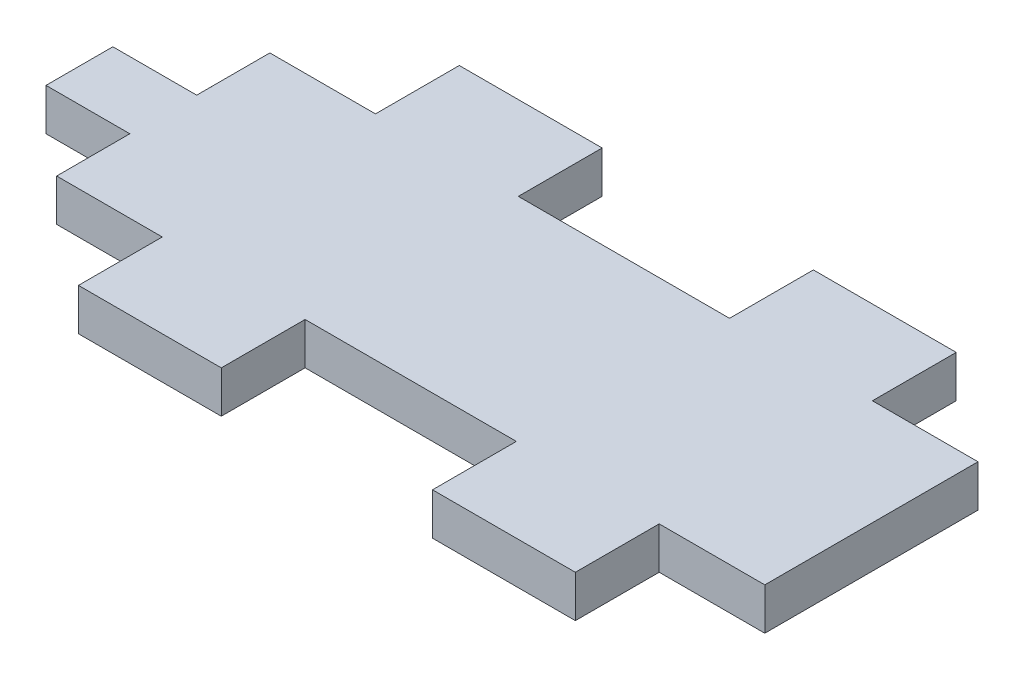
ISO-10303-21;
HEADER;
FILE_DESCRIPTION(('STEP AP214'),'2;1');
FILE_NAME('part.step','',(''),(''),'','','');
FILE_SCHEMA(('AUTOMOTIVE_DESIGN { 1 0 10303 214 1 1 1 1 }'));
ENDSEC;
DATA;
#1=APPLICATION_CONTEXT('core data for automotive mechanical design processes');
#2=APPLICATION_PROTOCOL_DEFINITION('international standard','automotive_design',2000,#1);
#3=PRODUCT_CONTEXT('',#1,'mechanical');
#4=PRODUCT('Part','Part','',(#3));
#5=PRODUCT_RELATED_PRODUCT_CATEGORY('part','',(#4));
#6=PRODUCT_DEFINITION_FORMATION('','',#4);
#7=PRODUCT_DEFINITION_CONTEXT('part definition',#1,'design');
#8=PRODUCT_DEFINITION('design','',#6,#7);
#9=PRODUCT_DEFINITION_SHAPE('','',#8);
#10=(LENGTH_UNIT() NAMED_UNIT(*) SI_UNIT(.MILLI.,.METRE.));
#11=(NAMED_UNIT(*) PLANE_ANGLE_UNIT() SI_UNIT($,.RADIAN.));
#12=(NAMED_UNIT(*) SI_UNIT($,.STERADIAN.) SOLID_ANGLE_UNIT());
#13=UNCERTAINTY_MEASURE_WITH_UNIT(LENGTH_MEASURE(1.E-05),#10,'distance_accuracy_value','');
#14=(GEOMETRIC_REPRESENTATION_CONTEXT(3) GLOBAL_UNCERTAINTY_ASSIGNED_CONTEXT((#13)) GLOBAL_UNIT_ASSIGNED_CONTEXT((#10,
#11,#12)) REPRESENTATION_CONTEXT('',''));
#15=CARTESIAN_POINT('',(0.,0.,0.));
#16=DIRECTION('',(0.,0.,1.));
#17=DIRECTION('',(1.,0.,0.));
#18=AXIS2_PLACEMENT_3D('',#15,#16,#17);
#19=CARTESIAN_POINT('',(26.82059633,3.175,8.075));
#20=DIRECTION('',(-1.,0.,0.));
#21=DIRECTION('',(0.,0.,1.));
#22=AXIS2_PLACEMENT_3D('',#19,#20,#21);
#23=PLANE('',#22);
#24=DIRECTION('',(0.,0.,-1.));
#25=VECTOR('',#24,1.);
#26=CARTESIAN_POINT('',(26.82059633,0.,8.075));
#27=LINE('',#26,#25);
#28=CARTESIAN_POINT('',(26.82059633,0.,8.075));
#29=VERTEX_POINT('',#28);
#30=CARTESIAN_POINT('',(26.82059633,0.,-8.075));
#31=VERTEX_POINT('',#30);
#32=EDGE_CURVE('E240',#29,#31,#27,.T.);
#33=ORIENTED_EDGE('',*,*,#32,.T.);
#34=DIRECTION('',(0.,-1.,0.));
#35=VECTOR('',#34,1.);
#36=CARTESIAN_POINT('',(26.82059633,3.175,-8.075));
#37=LINE('',#36,#35);
#38=CARTESIAN_POINT('',(26.82059633,3.175,-8.075));
#39=VERTEX_POINT('',#38);
#40=EDGE_CURVE('E11',#39,#31,#37,.T.);
#41=ORIENTED_EDGE('',*,*,#40,.F.);
#42=DIRECTION('',(0.,0.,-1.));
#43=VECTOR('',#42,1.);
#44=CARTESIAN_POINT('',(26.82059633,3.175,8.075));
#45=LINE('',#44,#43);
#46=CARTESIAN_POINT('',(26.82059633,3.175,8.075));
#47=VERTEX_POINT('',#46);
#48=EDGE_CURVE('E310',#47,#39,#45,.T.);
#49=ORIENTED_EDGE('',*,*,#48,.F.);
#50=DIRECTION('',(0.,-1.,0.));
#51=VECTOR('',#50,1.);
#52=CARTESIAN_POINT('',(26.82059633,3.175,8.075));
#53=LINE('',#52,#51);
#54=EDGE_CURVE('E236',#47,#29,#53,.T.);
#55=ORIENTED_EDGE('',*,*,#54,.T.);
#56=EDGE_LOOP('',(#33,#41,#49,#55));
#57=FACE_BOUND('',#56,.T.);
#58=ADVANCED_FACE('F43',(#57),#23,.F.);
#59=CARTESIAN_POINT('',(18.82059633,3.175,-8.075));
#60=DIRECTION('',(0.,0.,1.));
#61=DIRECTION('',(1.,0.,0.));
#62=AXIS2_PLACEMENT_3D('',#59,#60,#61);
#63=PLANE('',#62);
#64=DIRECTION('',(-1.,0.,0.));
#65=VECTOR('',#64,1.);
#66=CARTESIAN_POINT('',(18.82059633,0.,-8.075));
#67=LINE('',#66,#65);
#68=CARTESIAN_POINT('',(18.82059633,0.,-8.075));
#69=VERTEX_POINT('',#68);
#70=EDGE_CURVE('E244',#31,#69,#67,.T.);
#71=ORIENTED_EDGE('',*,*,#70,.T.);
#72=DIRECTION('',(0.,-1.,0.));
#73=VECTOR('',#72,1.);
#74=CARTESIAN_POINT('',(18.82059633,3.175,-8.075));
#75=LINE('',#74,#73);
#76=CARTESIAN_POINT('',(18.82059633,3.175,-8.075));
#77=VERTEX_POINT('',#76);
#78=EDGE_CURVE('E52',#77,#69,#75,.T.);
#79=ORIENTED_EDGE('',*,*,#78,.F.);
#80=DIRECTION('',(-1.,0.,0.));
#81=VECTOR('',#80,1.);
#82=CARTESIAN_POINT('',(18.82059633,3.175,-8.075));
#83=LINE('',#82,#81);
#84=EDGE_CURVE('E151',#39,#77,#83,.T.);
#85=ORIENTED_EDGE('',*,*,#84,.F.);
#86=ORIENTED_EDGE('',*,*,#40,.T.);
#87=EDGE_LOOP('',(#71,#79,#85,#86));
#88=FACE_BOUND('',#87,.T.);
#89=ADVANCED_FACE('F488',(#88),#63,.F.);
#90=CARTESIAN_POINT('',(18.82059633,3.175,-14.425));
#91=DIRECTION('',(-1.,0.,0.));
#92=DIRECTION('',(0.,0.,1.));
#93=AXIS2_PLACEMENT_3D('',#90,#91,#92);
#94=PLANE('',#93);
#95=DIRECTION('',(0.,0.,-1.));
#96=VECTOR('',#95,1.);
#97=CARTESIAN_POINT('',(18.82059633,0.,-14.425));
#98=LINE('',#97,#96);
#99=CARTESIAN_POINT('',(18.82059633,0.,-14.425));
#100=VERTEX_POINT('',#99);
#101=EDGE_CURVE('E247',#69,#100,#98,.T.);
#102=ORIENTED_EDGE('',*,*,#101,.T.);
#103=DIRECTION('',(0.,-1.,0.));
#104=VECTOR('',#103,1.);
#105=CARTESIAN_POINT('',(18.82059633,3.175,-14.425));
#106=LINE('',#105,#104);
#107=CARTESIAN_POINT('',(18.82059633,3.175,-14.425));
#108=VERTEX_POINT('',#107);
#109=EDGE_CURVE('E385',#108,#100,#106,.T.);
#110=ORIENTED_EDGE('',*,*,#109,.F.);
#111=DIRECTION('',(0.,0.,-1.));
#112=VECTOR('',#111,1.);
#113=CARTESIAN_POINT('',(18.82059633,3.175,-14.425));
#114=LINE('',#113,#112);
#115=EDGE_CURVE('E395',#77,#108,#114,.T.);
#116=ORIENTED_EDGE('',*,*,#115,.F.);
#117=ORIENTED_EDGE('',*,*,#78,.T.);
#118=EDGE_LOOP('',(#102,#110,#116,#117));
#119=FACE_BOUND('',#118,.T.);
#120=ADVANCED_FACE('F393',(#119),#94,.F.);
#121=CARTESIAN_POINT('',(8.,3.175,-14.425));
#122=DIRECTION('',(0.,0.,1.));
#123=DIRECTION('',(1.,0.,0.));
#124=AXIS2_PLACEMENT_3D('',#121,#122,#123);
#125=PLANE('',#124);
#126=DIRECTION('',(-1.,0.,0.));
#127=VECTOR('',#126,1.);
#128=CARTESIAN_POINT('',(8.,0.,-14.425));
#129=LINE('',#128,#127);
#130=CARTESIAN_POINT('',(8.,0.,-14.425));
#131=VERTEX_POINT('',#130);
#132=EDGE_CURVE('E250',#100,#131,#129,.T.);
#133=ORIENTED_EDGE('',*,*,#132,.T.);
#134=DIRECTION('',(0.,-1.,0.));
#135=VECTOR('',#134,1.);
#136=CARTESIAN_POINT('',(8.,3.175,-14.425));
#137=LINE('',#136,#135);
#138=CARTESIAN_POINT('',(8.,3.175,-14.425));
#139=VERTEX_POINT('',#138);
#140=EDGE_CURVE('E381',#139,#131,#137,.T.);
#141=ORIENTED_EDGE('',*,*,#140,.F.);
#142=DIRECTION('',(-1.,0.,0.));
#143=VECTOR('',#142,1.);
#144=CARTESIAN_POINT('',(8.,3.175,-14.425));
#145=LINE('',#144,#143);
#146=EDGE_CURVE('E414',#108,#139,#145,.T.);
#147=ORIENTED_EDGE('',*,*,#146,.F.);
#148=ORIENTED_EDGE('',*,*,#109,.T.);
#149=EDGE_LOOP('',(#133,#141,#147,#148));
#150=FACE_BOUND('',#149,.T.);
#151=ADVANCED_FACE('F404',(#150),#125,.F.);
#152=CARTESIAN_POINT('',(8.,3.175,-8.075));
#153=DIRECTION('',(1.,0.,0.));
#154=DIRECTION('',(0.,0.,-1.));
#155=AXIS2_PLACEMENT_3D('',#152,#153,#154);
#156=PLANE('',#155);
#157=DIRECTION('',(0.,0.,1.));
#158=VECTOR('',#157,1.);
#159=CARTESIAN_POINT('',(8.,0.,-8.075));
#160=LINE('',#159,#158);
#161=CARTESIAN_POINT('',(8.,0.,-8.075));
#162=VERTEX_POINT('',#161);
#163=EDGE_CURVE('E253',#131,#162,#160,.T.);
#164=ORIENTED_EDGE('',*,*,#163,.T.);
#165=DIRECTION('',(0.,-1.,0.));
#166=VECTOR('',#165,1.);
#167=CARTESIAN_POINT('',(8.,3.175,-8.075));
#168=LINE('',#167,#166);
#169=CARTESIAN_POINT('',(8.,3.175,-8.075));
#170=VERTEX_POINT('',#169);
#171=EDGE_CURVE('E377',#170,#162,#168,.T.);
#172=ORIENTED_EDGE('',*,*,#171,.F.);
#173=DIRECTION('',(0.,0.,1.));
#174=VECTOR('',#173,1.);
#175=CARTESIAN_POINT('',(8.,3.175,-8.075));
#176=LINE('',#175,#174);
#177=EDGE_CURVE('E410',#139,#170,#176,.T.);
#178=ORIENTED_EDGE('',*,*,#177,.F.);
#179=ORIENTED_EDGE('',*,*,#140,.T.);
#180=EDGE_LOOP('',(#164,#172,#178,#179));
#181=FACE_BOUND('',#180,.T.);
#182=ADVANCED_FACE('F408',(#181),#156,.F.);
#183=CARTESIAN_POINT('',(-7.99999999999999,3.175,-8.075));
#184=DIRECTION('',(0.,0.,1.));
#185=DIRECTION('',(1.,0.,0.));
#186=AXIS2_PLACEMENT_3D('',#183,#184,#185);
#187=PLANE('',#186);
#188=DIRECTION('',(-1.,0.,0.));
#189=VECTOR('',#188,1.);
#190=CARTESIAN_POINT('',(-7.99999999999999,0.,-8.075));
#191=LINE('',#190,#189);
#192=CARTESIAN_POINT('',(-7.99999999999999,0.,-8.075));
#193=VERTEX_POINT('',#192);
#194=EDGE_CURVE('E256',#162,#193,#191,.T.);
#195=ORIENTED_EDGE('',*,*,#194,.T.);
#196=DIRECTION('',(0.,-1.,0.));
#197=VECTOR('',#196,1.);
#198=CARTESIAN_POINT('',(-7.99999999999999,3.175,-8.075));
#199=LINE('',#198,#197);
#200=CARTESIAN_POINT('',(-7.99999999999999,3.175,-8.075));
#201=VERTEX_POINT('',#200);
#202=EDGE_CURVE('E373',#201,#193,#199,.T.);
#203=ORIENTED_EDGE('',*,*,#202,.F.);
#204=DIRECTION('',(-1.,0.,0.));
#205=VECTOR('',#204,1.);
#206=CARTESIAN_POINT('',(-7.99999999999999,3.175,-8.075));
#207=LINE('',#206,#205);
#208=EDGE_CURVE('E413',#170,#201,#207,.T.);
#209=ORIENTED_EDGE('',*,*,#208,.F.);
#210=ORIENTED_EDGE('',*,*,#171,.T.);
#211=EDGE_LOOP('',(#195,#203,#209,#210));
#212=FACE_BOUND('',#211,.T.);
#213=ADVANCED_FACE('F501',(#212),#187,.F.);
#214=CARTESIAN_POINT('',(-7.99999999999999,3.175,-8.075));
#215=DIRECTION('',(-1.,0.,0.));
#216=DIRECTION('',(0.,0.,1.));
#217=AXIS2_PLACEMENT_3D('',#214,#215,#216);
#218=PLANE('',#217);
#219=DIRECTION('',(0.,0.,-1.));
#220=VECTOR('',#219,1.);
#221=CARTESIAN_POINT('',(-7.99999999999999,0.,-8.075));
#222=LINE('',#221,#220);
#223=CARTESIAN_POINT('',(-7.99999999999999,0.,-14.425));
#224=VERTEX_POINT('',#223);
#225=EDGE_CURVE('E259',#193,#224,#222,.T.);
#226=ORIENTED_EDGE('',*,*,#225,.T.);
#227=DIRECTION('',(0.,-1.,0.));
#228=VECTOR('',#227,1.);
#229=CARTESIAN_POINT('',(-7.99999999999999,3.175,-14.425));
#230=LINE('',#229,#228);
#231=CARTESIAN_POINT('',(-7.99999999999999,3.175,-14.425));
#232=VERTEX_POINT('',#231);
#233=EDGE_CURVE('E369',#232,#224,#230,.T.);
#234=ORIENTED_EDGE('',*,*,#233,.F.);
#235=DIRECTION('',(0.,0.,-1.));
#236=VECTOR('',#235,1.);
#237=CARTESIAN_POINT('',(-7.99999999999999,3.175,-8.075));
#238=LINE('',#237,#236);
#239=EDGE_CURVE('E418',#201,#232,#238,.T.);
#240=ORIENTED_EDGE('',*,*,#239,.F.);
#241=ORIENTED_EDGE('',*,*,#202,.T.);
#242=EDGE_LOOP('',(#226,#234,#240,#241));
#243=FACE_BOUND('',#242,.T.);
#244=ADVANCED_FACE('F504',(#243),#218,.F.);
#245=CARTESIAN_POINT('',(-7.99999999999999,3.175,-14.425));
#246=DIRECTION('',(0.,0.,1.));
#247=DIRECTION('',(1.,0.,0.));
#248=AXIS2_PLACEMENT_3D('',#245,#246,#247);
#249=PLANE('',#248);
#250=DIRECTION('',(-1.,0.,0.));
#251=VECTOR('',#250,1.);
#252=CARTESIAN_POINT('',(-7.99999999999999,0.,-14.425));
#253=LINE('',#252,#251);
#254=CARTESIAN_POINT('',(-18.82059633,0.,-14.425));
#255=VERTEX_POINT('',#254);
#256=EDGE_CURVE('E262',#224,#255,#253,.T.);
#257=ORIENTED_EDGE('',*,*,#256,.T.);
#258=DIRECTION('',(0.,-1.,0.));
#259=VECTOR('',#258,1.);
#260=CARTESIAN_POINT('',(-18.82059633,3.175,-14.425));
#261=LINE('',#260,#259);
#262=CARTESIAN_POINT('',(-18.82059633,3.175,-14.425));
#263=VERTEX_POINT('',#262);
#264=EDGE_CURVE('E365',#263,#255,#261,.T.);
#265=ORIENTED_EDGE('',*,*,#264,.F.);
#266=DIRECTION('',(-1.,0.,0.));
#267=VECTOR('',#266,1.);
#268=CARTESIAN_POINT('',(-7.99999999999999,3.175,-14.425));
#269=LINE('',#268,#267);
#270=EDGE_CURVE('E425',#232,#263,#269,.T.);
#271=ORIENTED_EDGE('',*,*,#270,.F.);
#272=ORIENTED_EDGE('',*,*,#233,.T.);
#273=EDGE_LOOP('',(#257,#265,#271,#272));
#274=FACE_BOUND('',#273,.T.);
#275=ADVANCED_FACE('F508',(#274),#249,.F.);
#276=CARTESIAN_POINT('',(-18.82059633,3.175,-14.425));
#277=DIRECTION('',(1.,0.,0.));
#278=DIRECTION('',(0.,0.,-1.));
#279=AXIS2_PLACEMENT_3D('',#276,#277,#278);
#280=PLANE('',#279);
#281=DIRECTION('',(0.,0.,1.));
#282=VECTOR('',#281,1.);
#283=CARTESIAN_POINT('',(-18.82059633,0.,-14.425));
#284=LINE('',#283,#282);
#285=CARTESIAN_POINT('',(-18.82059633,0.,-8.075));
#286=VERTEX_POINT('',#285);
#287=EDGE_CURVE('E265',#255,#286,#284,.T.);
#288=ORIENTED_EDGE('',*,*,#287,.T.);
#289=DIRECTION('',(0.,-1.,0.));
#290=VECTOR('',#289,1.);
#291=CARTESIAN_POINT('',(-18.82059633,3.175,-8.075));
#292=LINE('',#291,#290);
#293=CARTESIAN_POINT('',(-18.82059633,3.175,-8.075));
#294=VERTEX_POINT('',#293);
#295=EDGE_CURVE('E361',#294,#286,#292,.T.);
#296=ORIENTED_EDGE('',*,*,#295,.F.);
#297=DIRECTION('',(0.,0.,1.));
#298=VECTOR('',#297,1.);
#299=CARTESIAN_POINT('',(-18.82059633,3.175,-14.425));
#300=LINE('',#299,#298);
#301=EDGE_CURVE('E428',#263,#294,#300,.T.);
#302=ORIENTED_EDGE('',*,*,#301,.F.);
#303=ORIENTED_EDGE('',*,*,#264,.T.);
#304=EDGE_LOOP('',(#288,#296,#302,#303));
#305=FACE_BOUND('',#304,.T.);
#306=ADVANCED_FACE('F512',(#305),#280,.F.);
#307=CARTESIAN_POINT('',(-18.82059633,3.175,-8.075));
#308=DIRECTION('',(0.,0.,1.));
#309=DIRECTION('',(1.,0.,0.));
#310=AXIS2_PLACEMENT_3D('',#307,#308,#309);
#311=PLANE('',#310);
#312=DIRECTION('',(-1.,0.,0.));
#313=VECTOR('',#312,1.);
#314=CARTESIAN_POINT('',(-18.82059633,0.,-8.075));
#315=LINE('',#314,#313);
#316=CARTESIAN_POINT('',(-26.82059633,0.,-8.075));
#317=VERTEX_POINT('',#316);
#318=EDGE_CURVE('E268',#286,#317,#315,.T.);
#319=ORIENTED_EDGE('',*,*,#318,.T.);
#320=DIRECTION('',(0.,-1.,0.));
#321=VECTOR('',#320,1.);
#322=CARTESIAN_POINT('',(-26.82059633,3.175,-8.075));
#323=LINE('',#322,#321);
#324=CARTESIAN_POINT('',(-26.82059633,3.175,-8.075));
#325=VERTEX_POINT('',#324);
#326=EDGE_CURVE('E357',#325,#317,#323,.T.);
#327=ORIENTED_EDGE('',*,*,#326,.F.);
#328=DIRECTION('',(-1.,0.,0.));
#329=VECTOR('',#328,1.);
#330=CARTESIAN_POINT('',(-18.82059633,3.175,-8.075));
#331=LINE('',#330,#329);
#332=EDGE_CURVE('E431',#294,#325,#331,.T.);
#333=ORIENTED_EDGE('',*,*,#332,.F.);
#334=ORIENTED_EDGE('',*,*,#295,.T.);
#335=EDGE_LOOP('',(#319,#327,#333,#334));
#336=FACE_BOUND('',#335,.T.);
#337=ADVANCED_FACE('F516',(#336),#311,.F.);
#338=CARTESIAN_POINT('',(-26.82059633,3.175,-8.075));
#339=DIRECTION('',(1.,0.,0.));
#340=DIRECTION('',(0.,0.,-1.));
#341=AXIS2_PLACEMENT_3D('',#338,#339,#340);
#342=PLANE('',#341);
#343=DIRECTION('',(0.,0.,1.));
#344=VECTOR('',#343,1.);
#345=CARTESIAN_POINT('',(-26.82059633,0.,-8.075));
#346=LINE('',#345,#344);
#347=CARTESIAN_POINT('',(-26.82059633,0.,-2.5325));
#348=VERTEX_POINT('',#347);
#349=EDGE_CURVE('E271',#317,#348,#346,.T.);
#350=ORIENTED_EDGE('',*,*,#349,.T.);
#351=DIRECTION('',(0.,-1.,0.));
#352=VECTOR('',#351,1.);
#353=CARTESIAN_POINT('',(-26.82059633,3.175,-2.5325));
#354=LINE('',#353,#352);
#355=CARTESIAN_POINT('',(-26.82059633,3.175,-2.5325));
#356=VERTEX_POINT('',#355);
#357=EDGE_CURVE('E353',#356,#348,#354,.T.);
#358=ORIENTED_EDGE('',*,*,#357,.F.);
#359=DIRECTION('',(0.,0.,1.));
#360=VECTOR('',#359,1.);
#361=CARTESIAN_POINT('',(-26.82059633,3.175,-8.075));
#362=LINE('',#361,#360);
#363=EDGE_CURVE('E434',#325,#356,#362,.T.);
#364=ORIENTED_EDGE('',*,*,#363,.F.);
#365=ORIENTED_EDGE('',*,*,#326,.T.);
#366=EDGE_LOOP('',(#350,#358,#364,#365));
#367=FACE_BOUND('',#366,.T.);
#368=ADVANCED_FACE('F520',(#367),#342,.F.);
#369=CARTESIAN_POINT('',(-33.17059633,3.175,-2.5325));
#370=DIRECTION('',(0.,0.,1.));
#371=DIRECTION('',(1.,0.,0.));
#372=AXIS2_PLACEMENT_3D('',#369,#370,#371);
#373=PLANE('',#372);
#374=DIRECTION('',(-1.,0.,0.));
#375=VECTOR('',#374,1.);
#376=CARTESIAN_POINT('',(-33.17059633,0.,-2.5325));
#377=LINE('',#376,#375);
#378=CARTESIAN_POINT('',(-33.17059633,0.,-2.5325));
#379=VERTEX_POINT('',#378);
#380=EDGE_CURVE('E274',#348,#379,#377,.T.);
#381=ORIENTED_EDGE('',*,*,#380,.T.);
#382=DIRECTION('',(0.,-1.,0.));
#383=VECTOR('',#382,1.);
#384=CARTESIAN_POINT('',(-33.17059633,3.175,-2.5325));
#385=LINE('',#384,#383);
#386=CARTESIAN_POINT('',(-33.17059633,3.175,-2.5325));
#387=VERTEX_POINT('',#386);
#388=EDGE_CURVE('E349',#387,#379,#385,.T.);
#389=ORIENTED_EDGE('',*,*,#388,.F.);
#390=DIRECTION('',(-1.,0.,0.));
#391=VECTOR('',#390,1.);
#392=CARTESIAN_POINT('',(-33.17059633,3.175,-2.5325));
#393=LINE('',#392,#391);
#394=EDGE_CURVE('E437',#356,#387,#393,.T.);
#395=ORIENTED_EDGE('',*,*,#394,.F.);
#396=ORIENTED_EDGE('',*,*,#357,.T.);
#397=EDGE_LOOP('',(#381,#389,#395,#396));
#398=FACE_BOUND('',#397,.T.);
#399=ADVANCED_FACE('F524',(#398),#373,.F.);
#400=CARTESIAN_POINT('',(-33.17059633,3.175,2.5325));
#401=DIRECTION('',(1.,0.,0.));
#402=DIRECTION('',(0.,0.,-1.));
#403=AXIS2_PLACEMENT_3D('',#400,#401,#402);
#404=PLANE('',#403);
#405=DIRECTION('',(0.,0.,1.));
#406=VECTOR('',#405,1.);
#407=CARTESIAN_POINT('',(-33.17059633,0.,2.5325));
#408=LINE('',#407,#406);
#409=CARTESIAN_POINT('',(-33.17059633,0.,2.5325));
#410=VERTEX_POINT('',#409);
#411=EDGE_CURVE('E277',#379,#410,#408,.T.);
#412=ORIENTED_EDGE('',*,*,#411,.T.);
#413=DIRECTION('',(0.,-1.,0.));
#414=VECTOR('',#413,1.);
#415=CARTESIAN_POINT('',(-33.17059633,3.175,2.5325));
#416=LINE('',#415,#414);
#417=CARTESIAN_POINT('',(-33.17059633,3.175,2.5325));
#418=VERTEX_POINT('',#417);
#419=EDGE_CURVE('E345',#418,#410,#416,.T.);
#420=ORIENTED_EDGE('',*,*,#419,.F.);
#421=DIRECTION('',(0.,0.,1.));
#422=VECTOR('',#421,1.);
#423=CARTESIAN_POINT('',(-33.17059633,3.175,2.5325));
#424=LINE('',#423,#422);
#425=EDGE_CURVE('E440',#387,#418,#424,.T.);
#426=ORIENTED_EDGE('',*,*,#425,.F.);
#427=ORIENTED_EDGE('',*,*,#388,.T.);
#428=EDGE_LOOP('',(#412,#420,#426,#427));
#429=FACE_BOUND('',#428,.T.);
#430=ADVANCED_FACE('F528',(#429),#404,.F.);
#431=CARTESIAN_POINT('',(-33.17059633,3.175,2.5325));
#432=DIRECTION('',(0.,0.,-1.));
#433=DIRECTION('',(-1.,0.,0.));
#434=AXIS2_PLACEMENT_3D('',#431,#432,#433);
#435=PLANE('',#434);
#436=DIRECTION('',(1.,0.,0.));
#437=VECTOR('',#436,1.);
#438=CARTESIAN_POINT('',(-33.17059633,0.,2.5325));
#439=LINE('',#438,#437);
#440=CARTESIAN_POINT('',(-26.82059633,0.,2.5325));
#441=VERTEX_POINT('',#440);
#442=EDGE_CURVE('E280',#410,#441,#439,.T.);
#443=ORIENTED_EDGE('',*,*,#442,.T.);
#444=DIRECTION('',(0.,-1.,0.));
#445=VECTOR('',#444,1.);
#446=CARTESIAN_POINT('',(-26.82059633,3.175,2.5325));
#447=LINE('',#446,#445);
#448=CARTESIAN_POINT('',(-26.82059633,3.175,2.5325));
#449=VERTEX_POINT('',#448);
#450=EDGE_CURVE('E341',#449,#441,#447,.T.);
#451=ORIENTED_EDGE('',*,*,#450,.F.);
#452=DIRECTION('',(1.,0.,0.));
#453=VECTOR('',#452,1.);
#454=CARTESIAN_POINT('',(-33.17059633,3.175,2.5325));
#455=LINE('',#454,#453);
#456=EDGE_CURVE('E443',#418,#449,#455,.T.);
#457=ORIENTED_EDGE('',*,*,#456,.F.);
#458=ORIENTED_EDGE('',*,*,#419,.T.);
#459=EDGE_LOOP('',(#443,#451,#457,#458));
#460=FACE_BOUND('',#459,.T.);
#461=ADVANCED_FACE('F532',(#460),#435,.F.);
#462=CARTESIAN_POINT('',(-26.82059633,3.175,8.075));
#463=DIRECTION('',(1.,0.,0.));
#464=DIRECTION('',(0.,0.,-1.));
#465=AXIS2_PLACEMENT_3D('',#462,#463,#464);
#466=PLANE('',#465);
#467=DIRECTION('',(0.,0.,1.));
#468=VECTOR('',#467,1.);
#469=CARTESIAN_POINT('',(-26.82059633,0.,8.075));
#470=LINE('',#469,#468);
#471=CARTESIAN_POINT('',(-26.82059633,0.,8.075));
#472=VERTEX_POINT('',#471);
#473=EDGE_CURVE('E283',#441,#472,#470,.T.);
#474=ORIENTED_EDGE('',*,*,#473,.T.);
#475=DIRECTION('',(0.,-1.,0.));
#476=VECTOR('',#475,1.);
#477=CARTESIAN_POINT('',(-26.82059633,3.175,8.075));
#478=LINE('',#477,#476);
#479=CARTESIAN_POINT('',(-26.82059633,3.175,8.075));
#480=VERTEX_POINT('',#479);
#481=EDGE_CURVE('E337',#480,#472,#478,.T.);
#482=ORIENTED_EDGE('',*,*,#481,.F.);
#483=DIRECTION('',(0.,0.,1.));
#484=VECTOR('',#483,1.);
#485=CARTESIAN_POINT('',(-26.82059633,3.175,8.075));
#486=LINE('',#485,#484);
#487=EDGE_CURVE('E446',#449,#480,#486,.T.);
#488=ORIENTED_EDGE('',*,*,#487,.F.);
#489=ORIENTED_EDGE('',*,*,#450,.T.);
#490=EDGE_LOOP('',(#474,#482,#488,#489));
#491=FACE_BOUND('',#490,.T.);
#492=ADVANCED_FACE('F536',(#491),#466,.F.);
#493=CARTESIAN_POINT('',(-18.82059633,3.175,8.075));
#494=DIRECTION('',(0.,0.,-1.));
#495=DIRECTION('',(-1.,0.,0.));
#496=AXIS2_PLACEMENT_3D('',#493,#494,#495);
#497=PLANE('',#496);
#498=DIRECTION('',(1.,0.,0.));
#499=VECTOR('',#498,1.);
#500=CARTESIAN_POINT('',(-18.82059633,0.,8.075));
#501=LINE('',#500,#499);
#502=CARTESIAN_POINT('',(-18.82059633,0.,8.075));
#503=VERTEX_POINT('',#502);
#504=EDGE_CURVE('E286',#472,#503,#501,.T.);
#505=ORIENTED_EDGE('',*,*,#504,.T.);
#506=DIRECTION('',(0.,-1.,0.));
#507=VECTOR('',#506,1.);
#508=CARTESIAN_POINT('',(-18.82059633,3.175,8.075));
#509=LINE('',#508,#507);
#510=CARTESIAN_POINT('',(-18.82059633,3.175,8.075));
#511=VERTEX_POINT('',#510);
#512=EDGE_CURVE('E333',#511,#503,#509,.T.);
#513=ORIENTED_EDGE('',*,*,#512,.F.);
#514=DIRECTION('',(1.,0.,0.));
#515=VECTOR('',#514,1.);
#516=CARTESIAN_POINT('',(-18.82059633,3.175,8.075));
#517=LINE('',#516,#515);
#518=EDGE_CURVE('E449',#480,#511,#517,.T.);
#519=ORIENTED_EDGE('',*,*,#518,.F.);
#520=ORIENTED_EDGE('',*,*,#481,.T.);
#521=EDGE_LOOP('',(#505,#513,#519,#520));
#522=FACE_BOUND('',#521,.T.);
#523=ADVANCED_FACE('F540',(#522),#497,.F.);
#524=CARTESIAN_POINT('',(-18.82059633,3.175,14.425));
#525=DIRECTION('',(1.,0.,0.));
#526=DIRECTION('',(0.,0.,-1.));
#527=AXIS2_PLACEMENT_3D('',#524,#525,#526);
#528=PLANE('',#527);
#529=DIRECTION('',(0.,0.,1.));
#530=VECTOR('',#529,1.);
#531=CARTESIAN_POINT('',(-18.82059633,0.,14.425));
#532=LINE('',#531,#530);
#533=CARTESIAN_POINT('',(-18.82059633,0.,14.425));
#534=VERTEX_POINT('',#533);
#535=EDGE_CURVE('E289',#503,#534,#532,.T.);
#536=ORIENTED_EDGE('',*,*,#535,.T.);
#537=DIRECTION('',(0.,-1.,0.));
#538=VECTOR('',#537,1.);
#539=CARTESIAN_POINT('',(-18.82059633,3.175,14.425));
#540=LINE('',#539,#538);
#541=CARTESIAN_POINT('',(-18.82059633,3.175,14.425));
#542=VERTEX_POINT('',#541);
#543=EDGE_CURVE('E329',#542,#534,#540,.T.);
#544=ORIENTED_EDGE('',*,*,#543,.F.);
#545=DIRECTION('',(0.,0.,1.));
#546=VECTOR('',#545,1.);
#547=CARTESIAN_POINT('',(-18.82059633,3.175,14.425));
#548=LINE('',#547,#546);
#549=EDGE_CURVE('E452',#511,#542,#548,.T.);
#550=ORIENTED_EDGE('',*,*,#549,.F.);
#551=ORIENTED_EDGE('',*,*,#512,.T.);
#552=EDGE_LOOP('',(#536,#544,#550,#551));
#553=FACE_BOUND('',#552,.T.);
#554=ADVANCED_FACE('F544',(#553),#528,.F.);
#555=CARTESIAN_POINT('',(-7.99999999999999,3.175,14.425));
#556=DIRECTION('',(0.,0.,-1.));
#557=DIRECTION('',(-1.,0.,0.));
#558=AXIS2_PLACEMENT_3D('',#555,#556,#557);
#559=PLANE('',#558);
#560=DIRECTION('',(1.,0.,0.));
#561=VECTOR('',#560,1.);
#562=CARTESIAN_POINT('',(-7.99999999999999,0.,14.425));
#563=LINE('',#562,#561);
#564=CARTESIAN_POINT('',(-7.99999999999999,0.,14.425));
#565=VERTEX_POINT('',#564);
#566=EDGE_CURVE('E292',#534,#565,#563,.T.);
#567=ORIENTED_EDGE('',*,*,#566,.T.);
#568=DIRECTION('',(0.,-1.,0.));
#569=VECTOR('',#568,1.);
#570=CARTESIAN_POINT('',(-7.99999999999999,3.175,14.425));
#571=LINE('',#570,#569);
#572=CARTESIAN_POINT('',(-7.99999999999999,3.175,14.425));
#573=VERTEX_POINT('',#572);
#574=EDGE_CURVE('E325',#573,#565,#571,.T.);
#575=ORIENTED_EDGE('',*,*,#574,.F.);
#576=DIRECTION('',(1.,0.,0.));
#577=VECTOR('',#576,1.);
#578=CARTESIAN_POINT('',(-7.99999999999999,3.175,14.425));
#579=LINE('',#578,#577);
#580=EDGE_CURVE('E455',#542,#573,#579,.T.);
#581=ORIENTED_EDGE('',*,*,#580,.F.);
#582=ORIENTED_EDGE('',*,*,#543,.T.);
#583=EDGE_LOOP('',(#567,#575,#581,#582));
#584=FACE_BOUND('',#583,.T.);
#585=ADVANCED_FACE('F548',(#584),#559,.F.);
#586=CARTESIAN_POINT('',(-7.99999999999999,3.175,8.075));
#587=DIRECTION('',(-1.,0.,0.));
#588=DIRECTION('',(0.,0.,1.));
#589=AXIS2_PLACEMENT_3D('',#586,#587,#588);
#590=PLANE('',#589);
#591=DIRECTION('',(0.,0.,-1.));
#592=VECTOR('',#591,1.);
#593=CARTESIAN_POINT('',(-7.99999999999999,0.,8.075));
#594=LINE('',#593,#592);
#595=CARTESIAN_POINT('',(-7.99999999999999,0.,8.075));
#596=VERTEX_POINT('',#595);
#597=EDGE_CURVE('E295',#565,#596,#594,.T.);
#598=ORIENTED_EDGE('',*,*,#597,.T.);
#599=DIRECTION('',(0.,-1.,0.));
#600=VECTOR('',#599,1.);
#601=CARTESIAN_POINT('',(-7.99999999999999,3.175,8.075));
#602=LINE('',#601,#600);
#603=CARTESIAN_POINT('',(-7.99999999999999,3.175,8.075));
#604=VERTEX_POINT('',#603);
#605=EDGE_CURVE('E321',#604,#596,#602,.T.);
#606=ORIENTED_EDGE('',*,*,#605,.F.);
#607=DIRECTION('',(0.,0.,-1.));
#608=VECTOR('',#607,1.);
#609=CARTESIAN_POINT('',(-7.99999999999999,3.175,8.075));
#610=LINE('',#609,#608);
#611=EDGE_CURVE('E458',#573,#604,#610,.T.);
#612=ORIENTED_EDGE('',*,*,#611,.F.);
#613=ORIENTED_EDGE('',*,*,#574,.T.);
#614=EDGE_LOOP('',(#598,#606,#612,#613));
#615=FACE_BOUND('',#614,.T.);
#616=ADVANCED_FACE('F552',(#615),#590,.F.);
#617=CARTESIAN_POINT('',(-7.99999999999999,3.175,8.075));
#618=DIRECTION('',(0.,0.,-1.));
#619=DIRECTION('',(-1.,0.,0.));
#620=AXIS2_PLACEMENT_3D('',#617,#618,#619);
#621=PLANE('',#620);
#622=DIRECTION('',(1.,0.,0.));
#623=VECTOR('',#622,1.);
#624=CARTESIAN_POINT('',(-7.99999999999999,0.,8.075));
#625=LINE('',#624,#623);
#626=CARTESIAN_POINT('',(8.,0.,8.075));
#627=VERTEX_POINT('',#626);
#628=EDGE_CURVE('E298',#596,#627,#625,.T.);
#629=ORIENTED_EDGE('',*,*,#628,.T.);
#630=DIRECTION('',(0.,-1.,0.));
#631=VECTOR('',#630,1.);
#632=CARTESIAN_POINT('',(8.,3.175,8.075));
#633=LINE('',#632,#631);
#634=CARTESIAN_POINT('',(8.,3.175,8.075));
#635=VERTEX_POINT('',#634);
#636=EDGE_CURVE('E317',#635,#627,#633,.T.);
#637=ORIENTED_EDGE('',*,*,#636,.F.);
#638=DIRECTION('',(1.,0.,0.));
#639=VECTOR('',#638,1.);
#640=CARTESIAN_POINT('',(-7.99999999999999,3.175,8.075));
#641=LINE('',#640,#639);
#642=EDGE_CURVE('E461',#604,#635,#641,.T.);
#643=ORIENTED_EDGE('',*,*,#642,.F.);
#644=ORIENTED_EDGE('',*,*,#605,.T.);
#645=EDGE_LOOP('',(#629,#637,#643,#644));
#646=FACE_BOUND('',#645,.T.);
#647=ADVANCED_FACE('F469',(#646),#621,.F.);
#648=CARTESIAN_POINT('',(8.,3.175,8.075));
#649=DIRECTION('',(1.,0.,0.));
#650=DIRECTION('',(0.,0.,-1.));
#651=AXIS2_PLACEMENT_3D('',#648,#649,#650);
#652=PLANE('',#651);
#653=DIRECTION('',(0.,0.,1.));
#654=VECTOR('',#653,1.);
#655=CARTESIAN_POINT('',(8.,0.,8.075));
#656=LINE('',#655,#654);
#657=CARTESIAN_POINT('',(8.,0.,14.425));
#658=VERTEX_POINT('',#657);
#659=EDGE_CURVE('E301',#627,#658,#656,.T.);
#660=ORIENTED_EDGE('',*,*,#659,.T.);
#661=DIRECTION('',(0.,-1.,0.));
#662=VECTOR('',#661,1.);
#663=CARTESIAN_POINT('',(8.,3.175,14.425));
#664=LINE('',#663,#662);
#665=CARTESIAN_POINT('',(8.,3.175,14.425));
#666=VERTEX_POINT('',#665);
#667=EDGE_CURVE('E229',#666,#658,#664,.T.);
#668=ORIENTED_EDGE('',*,*,#667,.F.);
#669=DIRECTION('',(0.,0.,1.));
#670=VECTOR('',#669,1.);
#671=CARTESIAN_POINT('',(8.,3.175,8.075));
#672=LINE('',#671,#670);
#673=EDGE_CURVE('E218',#635,#666,#672,.T.);
#674=ORIENTED_EDGE('',*,*,#673,.F.);
#675=ORIENTED_EDGE('',*,*,#636,.T.);
#676=EDGE_LOOP('',(#660,#668,#674,#675));
#677=FACE_BOUND('',#676,.T.);
#678=ADVANCED_FACE('F473',(#677),#652,.F.);
#679=CARTESIAN_POINT('',(8.,3.175,14.425));
#680=DIRECTION('',(0.,0.,-1.));
#681=DIRECTION('',(-1.,0.,0.));
#682=AXIS2_PLACEMENT_3D('',#679,#680,#681);
#683=PLANE('',#682);
#684=DIRECTION('',(1.,0.,0.));
#685=VECTOR('',#684,1.);
#686=CARTESIAN_POINT('',(8.,0.,14.425));
#687=LINE('',#686,#685);
#688=CARTESIAN_POINT('',(18.82059633,0.,14.425));
#689=VERTEX_POINT('',#688);
#690=EDGE_CURVE('E227',#658,#689,#687,.T.);
#691=ORIENTED_EDGE('',*,*,#690,.T.);
#692=DIRECTION('',(0.,-1.,0.));
#693=VECTOR('',#692,1.);
#694=CARTESIAN_POINT('',(18.82059633,3.175,14.425));
#695=LINE('',#694,#693);
#696=CARTESIAN_POINT('',(18.82059633,3.175,14.425));
#697=VERTEX_POINT('',#696);
#698=EDGE_CURVE('E224',#697,#689,#695,.T.);
#699=ORIENTED_EDGE('',*,*,#698,.F.);
#700=DIRECTION('',(1.,0.,0.));
#701=VECTOR('',#700,1.);
#702=CARTESIAN_POINT('',(8.,3.175,14.425));
#703=LINE('',#702,#701);
#704=EDGE_CURVE('E212',#666,#697,#703,.T.);
#705=ORIENTED_EDGE('',*,*,#704,.F.);
#706=ORIENTED_EDGE('',*,*,#667,.T.);
#707=EDGE_LOOP('',(#691,#699,#705,#706));
#708=FACE_BOUND('',#707,.T.);
#709=ADVANCED_FACE('F225',(#708),#683,.F.);
#710=CARTESIAN_POINT('',(18.82059633,3.175,14.425));
#711=DIRECTION('',(-1.,0.,0.));
#712=DIRECTION('',(0.,0.,1.));
#713=AXIS2_PLACEMENT_3D('',#710,#711,#712);
#714=PLANE('',#713);
#715=DIRECTION('',(0.,0.,-1.));
#716=VECTOR('',#715,1.);
#717=CARTESIAN_POINT('',(18.82059633,0.,14.425));
#718=LINE('',#717,#716);
#719=CARTESIAN_POINT('',(18.82059633,0.,8.075));
#720=VERTEX_POINT('',#719);
#721=EDGE_CURVE('E137',#689,#720,#718,.T.);
#722=ORIENTED_EDGE('',*,*,#721,.T.);
#723=DIRECTION('',(0.,-1.,0.));
#724=VECTOR('',#723,1.);
#725=CARTESIAN_POINT('',(18.82059633,3.175,8.075));
#726=LINE('',#725,#724);
#727=CARTESIAN_POINT('',(18.82059633,3.175,8.075));
#728=VERTEX_POINT('',#727);
#729=EDGE_CURVE('E230',#728,#720,#726,.T.);
#730=ORIENTED_EDGE('',*,*,#729,.F.);
#731=DIRECTION('',(0.,0.,-1.));
#732=VECTOR('',#731,1.);
#733=CARTESIAN_POINT('',(18.82059633,3.175,14.425));
#734=LINE('',#733,#732);
#735=EDGE_CURVE('E216',#697,#728,#734,.T.);
#736=ORIENTED_EDGE('',*,*,#735,.F.);
#737=ORIENTED_EDGE('',*,*,#698,.T.);
#738=EDGE_LOOP('',(#722,#730,#736,#737));
#739=FACE_BOUND('',#738,.T.);
#740=ADVANCED_FACE('F232',(#739),#714,.F.);
#741=CARTESIAN_POINT('',(18.82059633,3.175,8.075));
#742=DIRECTION('',(0.,0.,-1.));
#743=DIRECTION('',(-1.,0.,0.));
#744=AXIS2_PLACEMENT_3D('',#741,#742,#743);
#745=PLANE('',#744);
#746=DIRECTION('',(1.,0.,0.));
#747=VECTOR('',#746,1.);
#748=CARTESIAN_POINT('',(18.82059633,0.,8.075));
#749=LINE('',#748,#747);
#750=EDGE_CURVE('E143',#720,#29,#749,.T.);
#751=ORIENTED_EDGE('',*,*,#750,.T.);
#752=ORIENTED_EDGE('',*,*,#54,.F.);
#753=DIRECTION('',(1.,0.,0.));
#754=VECTOR('',#753,1.);
#755=CARTESIAN_POINT('',(18.82059633,3.175,8.075));
#756=LINE('',#755,#754);
#757=EDGE_CURVE('E60',#728,#47,#756,.T.);
#758=ORIENTED_EDGE('',*,*,#757,.F.);
#759=ORIENTED_EDGE('',*,*,#729,.T.);
#760=EDGE_LOOP('',(#751,#752,#758,#759));
#761=FACE_BOUND('',#760,.T.);
#762=ADVANCED_FACE('F477',(#761),#745,.F.);
#763=CARTESIAN_POINT('',(0.,3.175,0.));
#764=DIRECTION('',(0.,-1.,0.));
#765=DIRECTION('',(0.,0.,-1.));
#766=AXIS2_PLACEMENT_3D('',#763,#764,#765);
#767=PLANE('',#766);
#768=ORIENTED_EDGE('',*,*,#48,.T.);
#769=ORIENTED_EDGE('',*,*,#84,.T.);
#770=ORIENTED_EDGE('',*,*,#115,.T.);
#771=ORIENTED_EDGE('',*,*,#146,.T.);
#772=ORIENTED_EDGE('',*,*,#177,.T.);
#773=ORIENTED_EDGE('',*,*,#208,.T.);
#774=ORIENTED_EDGE('',*,*,#239,.T.);
#775=ORIENTED_EDGE('',*,*,#270,.T.);
#776=ORIENTED_EDGE('',*,*,#301,.T.);
#777=ORIENTED_EDGE('',*,*,#332,.T.);
#778=ORIENTED_EDGE('',*,*,#363,.T.);
#779=ORIENTED_EDGE('',*,*,#394,.T.);
#780=ORIENTED_EDGE('',*,*,#425,.T.);
#781=ORIENTED_EDGE('',*,*,#456,.T.);
#782=ORIENTED_EDGE('',*,*,#487,.T.);
#783=ORIENTED_EDGE('',*,*,#518,.T.);
#784=ORIENTED_EDGE('',*,*,#549,.T.);
#785=ORIENTED_EDGE('',*,*,#580,.T.);
#786=ORIENTED_EDGE('',*,*,#611,.T.);
#787=ORIENTED_EDGE('',*,*,#642,.T.);
#788=ORIENTED_EDGE('',*,*,#673,.T.);
#789=ORIENTED_EDGE('',*,*,#704,.T.);
#790=ORIENTED_EDGE('',*,*,#735,.T.);
#791=ORIENTED_EDGE('',*,*,#757,.T.);
#792=EDGE_LOOP('',(#768,#769,#770,#771,#772,#773,#774,#775,#776,#777,#778,#779,#780,#781,#782,
#783,#784,#785,#786,#787,#788,#789,#790,#791));
#793=FACE_BOUND('',#792,.T.);
#794=ADVANCED_FACE('F214',(#793),#767,.F.);
#795=CARTESIAN_POINT('',(0.,0.,0.));
#796=DIRECTION('',(0.,-1.,0.));
#797=DIRECTION('',(0.,0.,-1.));
#798=AXIS2_PLACEMENT_3D('',#795,#796,#797);
#799=PLANE('',#798);
#800=ORIENTED_EDGE('',*,*,#32,.F.);
#801=ORIENTED_EDGE('',*,*,#750,.F.);
#802=ORIENTED_EDGE('',*,*,#721,.F.);
#803=ORIENTED_EDGE('',*,*,#690,.F.);
#804=ORIENTED_EDGE('',*,*,#659,.F.);
#805=ORIENTED_EDGE('',*,*,#628,.F.);
#806=ORIENTED_EDGE('',*,*,#597,.F.);
#807=ORIENTED_EDGE('',*,*,#566,.F.);
#808=ORIENTED_EDGE('',*,*,#535,.F.);
#809=ORIENTED_EDGE('',*,*,#504,.F.);
#810=ORIENTED_EDGE('',*,*,#473,.F.);
#811=ORIENTED_EDGE('',*,*,#442,.F.);
#812=ORIENTED_EDGE('',*,*,#411,.F.);
#813=ORIENTED_EDGE('',*,*,#380,.F.);
#814=ORIENTED_EDGE('',*,*,#349,.F.);
#815=ORIENTED_EDGE('',*,*,#318,.F.);
#816=ORIENTED_EDGE('',*,*,#287,.F.);
#817=ORIENTED_EDGE('',*,*,#256,.F.);
#818=ORIENTED_EDGE('',*,*,#225,.F.);
#819=ORIENTED_EDGE('',*,*,#194,.F.);
#820=ORIENTED_EDGE('',*,*,#163,.F.);
#821=ORIENTED_EDGE('',*,*,#132,.F.);
#822=ORIENTED_EDGE('',*,*,#101,.F.);
#823=ORIENTED_EDGE('',*,*,#70,.F.);
#824=EDGE_LOOP('',(#800,#801,#802,#803,#804,#805,#806,#807,#808,#809,#810,#811,#812,#813,#814,
#815,#816,#817,#818,#819,#820,#821,#822,#823));
#825=FACE_BOUND('',#824,.T.);
#826=ADVANCED_FACE('F399',(#825),#799,.T.);
#827=CLOSED_SHELL('',(#58,#89,#120,#151,#182,#213,#244,#275,#306,#337,#368,#399,#430,#461,#492,
#523,#554,#585,#616,#647,#678,#709,#740,#762,#794,#826));
#828=MANIFOLD_SOLID_BREP('B2',#827);
#829=ADVANCED_BREP_SHAPE_REPRESENTATION('',(#18,#828),#14);
#830=SHAPE_DEFINITION_REPRESENTATION(#9,#829);
ENDSEC;
END-ISO-10303-21;
